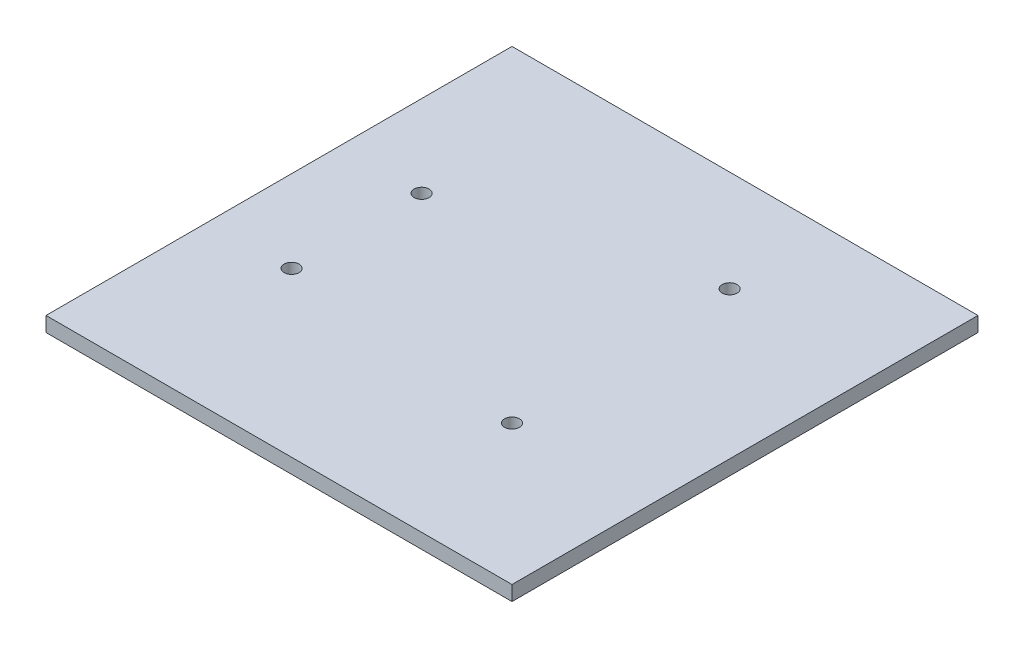
ISO-10303-21;
HEADER;
FILE_DESCRIPTION(('STEP AP214'),'2;1');
FILE_NAME('part.step','',(''),(''),'','','');
FILE_SCHEMA(('AUTOMOTIVE_DESIGN { 1 0 10303 214 1 1 1 1 }'));
ENDSEC;
DATA;
#1=APPLICATION_CONTEXT('core data for automotive mechanical design processes');
#2=APPLICATION_PROTOCOL_DEFINITION('international standard','automotive_design',2000,#1);
#3=PRODUCT_CONTEXT('',#1,'mechanical');
#4=PRODUCT('Part','Part','',(#3));
#5=PRODUCT_RELATED_PRODUCT_CATEGORY('part','',(#4));
#6=PRODUCT_DEFINITION_FORMATION('','',#4);
#7=PRODUCT_DEFINITION_CONTEXT('part definition',#1,'design');
#8=PRODUCT_DEFINITION('design','',#6,#7);
#9=PRODUCT_DEFINITION_SHAPE('','',#8);
#10=(LENGTH_UNIT() NAMED_UNIT(*) SI_UNIT(.MILLI.,.METRE.));
#11=(NAMED_UNIT(*) PLANE_ANGLE_UNIT() SI_UNIT($,.RADIAN.));
#12=(NAMED_UNIT(*) SI_UNIT($,.STERADIAN.) SOLID_ANGLE_UNIT());
#13=UNCERTAINTY_MEASURE_WITH_UNIT(LENGTH_MEASURE(1.E-05),#10,'distance_accuracy_value','');
#14=(GEOMETRIC_REPRESENTATION_CONTEXT(3) GLOBAL_UNCERTAINTY_ASSIGNED_CONTEXT((#13)) GLOBAL_UNIT_ASSIGNED_CONTEXT((#10,
#11,#12)) REPRESENTATION_CONTEXT('',''));
#15=CARTESIAN_POINT('',(0.,0.,0.));
#16=DIRECTION('',(0.,0.,1.));
#17=DIRECTION('',(1.,0.,0.));
#18=AXIS2_PLACEMENT_3D('',#15,#16,#17);
#19=CARTESIAN_POINT('',(50.,3.18,50.));
#20=DIRECTION('',(0.,0.,1.));
#21=DIRECTION('',(1.,0.,0.));
#22=AXIS2_PLACEMENT_3D('',#19,#20,#21);
#23=PLANE('',#22);
#24=DIRECTION('',(-1.,0.,0.));
#25=VECTOR('',#24,1.);
#26=CARTESIAN_POINT('',(50.,0.,50.));
#27=LINE('',#26,#25);
#28=CARTESIAN_POINT('',(50.,0.,50.));
#29=VERTEX_POINT('',#28);
#30=CARTESIAN_POINT('',(-50.,0.,50.));
#31=VERTEX_POINT('',#30);
#32=EDGE_CURVE('E99',#29,#31,#27,.T.);
#33=ORIENTED_EDGE('',*,*,#32,.F.);
#34=DIRECTION('',(0.,-1.,0.));
#35=VECTOR('',#34,1.);
#36=CARTESIAN_POINT('',(50.,3.18,50.));
#37=LINE('',#36,#35);
#38=CARTESIAN_POINT('',(50.,3.18,50.));
#39=VERTEX_POINT('',#38);
#40=EDGE_CURVE('E11',#39,#29,#37,.T.);
#41=ORIENTED_EDGE('',*,*,#40,.F.);
#42=DIRECTION('',(-1.,0.,0.));
#43=VECTOR('',#42,1.);
#44=CARTESIAN_POINT('',(50.,3.18,50.));
#45=LINE('',#44,#43);
#46=CARTESIAN_POINT('',(-50.,3.18,50.));
#47=VERTEX_POINT('',#46);
#48=EDGE_CURVE('E92',#39,#47,#45,.T.);
#49=ORIENTED_EDGE('',*,*,#48,.T.);
#50=DIRECTION('',(0.,-1.,0.));
#51=VECTOR('',#50,1.);
#52=CARTESIAN_POINT('',(-50.,3.18,50.));
#53=LINE('',#52,#51);
#54=EDGE_CURVE('E37',#47,#31,#53,.T.);
#55=ORIENTED_EDGE('',*,*,#54,.T.);
#56=EDGE_LOOP('',(#33,#41,#49,#55));
#57=FACE_BOUND('',#56,.T.);
#58=ADVANCED_FACE('F34',(#57),#23,.T.);
#59=CARTESIAN_POINT('',(50.,3.18,-50.));
#60=DIRECTION('',(1.,0.,0.));
#61=DIRECTION('',(0.,0.,-1.));
#62=AXIS2_PLACEMENT_3D('',#59,#60,#61);
#63=PLANE('',#62);
#64=DIRECTION('',(0.,0.,1.));
#65=VECTOR('',#64,1.);
#66=CARTESIAN_POINT('',(50.,0.,-50.));
#67=LINE('',#66,#65);
#68=CARTESIAN_POINT('',(50.,0.,-50.));
#69=VERTEX_POINT('',#68);
#70=EDGE_CURVE('E94',#69,#29,#67,.T.);
#71=ORIENTED_EDGE('',*,*,#70,.F.);
#72=DIRECTION('',(0.,-1.,0.));
#73=VECTOR('',#72,1.);
#74=CARTESIAN_POINT('',(50.,3.18,-50.));
#75=LINE('',#74,#73);
#76=CARTESIAN_POINT('',(50.,3.18,-50.));
#77=VERTEX_POINT('',#76);
#78=EDGE_CURVE('E43',#77,#69,#75,.T.);
#79=ORIENTED_EDGE('',*,*,#78,.F.);
#80=DIRECTION('',(0.,0.,1.));
#81=VECTOR('',#80,1.);
#82=CARTESIAN_POINT('',(50.,3.18,-50.));
#83=LINE('',#82,#81);
#84=EDGE_CURVE('E82',#77,#39,#83,.T.);
#85=ORIENTED_EDGE('',*,*,#84,.T.);
#86=ORIENTED_EDGE('',*,*,#40,.T.);
#87=EDGE_LOOP('',(#71,#79,#85,#86));
#88=FACE_BOUND('',#87,.T.);
#89=ADVANCED_FACE('F110',(#88),#63,.T.);
#90=CARTESIAN_POINT('',(50.,3.18,-50.));
#91=DIRECTION('',(0.,0.,1.));
#92=DIRECTION('',(1.,0.,0.));
#93=AXIS2_PLACEMENT_3D('',#90,#91,#92);
#94=PLANE('',#93);
#95=DIRECTION('',(-1.,0.,0.));
#96=VECTOR('',#95,1.);
#97=CARTESIAN_POINT('',(50.,0.,-50.));
#98=LINE('',#97,#96);
#99=CARTESIAN_POINT('',(-50.,0.,-50.));
#100=VERTEX_POINT('',#99);
#101=EDGE_CURVE('E87',#69,#100,#98,.T.);
#102=ORIENTED_EDGE('',*,*,#101,.T.);
#103=DIRECTION('',(0.,-1.,0.));
#104=VECTOR('',#103,1.);
#105=CARTESIAN_POINT('',(-50.,3.18,-50.));
#106=LINE('',#105,#104);
#107=CARTESIAN_POINT('',(-50.,3.18,-50.));
#108=VERTEX_POINT('',#107);
#109=EDGE_CURVE('E85',#108,#100,#106,.T.);
#110=ORIENTED_EDGE('',*,*,#109,.F.);
#111=DIRECTION('',(-1.,0.,0.));
#112=VECTOR('',#111,1.);
#113=CARTESIAN_POINT('',(50.,3.18,-50.));
#114=LINE('',#113,#112);
#115=EDGE_CURVE('E79',#77,#108,#114,.T.);
#116=ORIENTED_EDGE('',*,*,#115,.F.);
#117=ORIENTED_EDGE('',*,*,#78,.T.);
#118=EDGE_LOOP('',(#102,#110,#116,#117));
#119=FACE_BOUND('',#118,.T.);
#120=ADVANCED_FACE('F86',(#119),#94,.F.);
#121=CARTESIAN_POINT('',(-50.,3.18,-50.));
#122=DIRECTION('',(1.,0.,0.));
#123=DIRECTION('',(0.,0.,-1.));
#124=AXIS2_PLACEMENT_3D('',#121,#122,#123);
#125=PLANE('',#124);
#126=DIRECTION('',(0.,0.,1.));
#127=VECTOR('',#126,1.);
#128=CARTESIAN_POINT('',(-50.,0.,-50.));
#129=LINE('',#128,#127);
#130=EDGE_CURVE('E102',#100,#31,#129,.T.);
#131=ORIENTED_EDGE('',*,*,#130,.T.);
#132=ORIENTED_EDGE('',*,*,#54,.F.);
#133=DIRECTION('',(0.,0.,1.));
#134=VECTOR('',#133,1.);
#135=CARTESIAN_POINT('',(-50.,3.18,-50.));
#136=LINE('',#135,#134);
#137=EDGE_CURVE('E76',#108,#47,#136,.T.);
#138=ORIENTED_EDGE('',*,*,#137,.F.);
#139=ORIENTED_EDGE('',*,*,#109,.T.);
#140=EDGE_LOOP('',(#131,#132,#138,#139));
#141=FACE_BOUND('',#140,.T.);
#142=ADVANCED_FACE('F91',(#141),#125,.F.);
#143=CARTESIAN_POINT('',(0.,3.18,0.));
#144=DIRECTION('',(0.,1.,0.));
#145=DIRECTION('',(0.,0.,1.));
#146=AXIS2_PLACEMENT_3D('',#143,#144,#145);
#147=PLANE('',#146);
#148=CARTESIAN_POINT('',(20.,3.18,20.));
#149=DIRECTION('',(0.,1.,0.));
#150=DIRECTION('',(0.,0.,1.));
#151=AXIS2_PLACEMENT_3D('',#148,#149,#150);
#152=CIRCLE('',#151,1.60000000000001);
#153=CARTESIAN_POINT('',(20.,3.18,21.6));
#154=VERTEX_POINT('',#153);
#155=EDGE_CURVE('E170',#154,#154,#152,.T.);
#156=ORIENTED_EDGE('',*,*,#155,.F.);
#157=EDGE_LOOP('',(#156));
#158=FACE_BOUND('',#157,.T.);
#159=CARTESIAN_POINT('',(18.4,3.18,-28.3));
#160=DIRECTION('',(0.,1.,0.));
#161=DIRECTION('',(0.,0.,1.));
#162=AXIS2_PLACEMENT_3D('',#159,#160,#161);
#163=CIRCLE('',#162,1.60000000000001);
#164=CARTESIAN_POINT('',(18.4,3.18,-26.7));
#165=VERTEX_POINT('',#164);
#166=EDGE_CURVE('E162',#165,#165,#163,.T.);
#167=ORIENTED_EDGE('',*,*,#166,.F.);
#168=EDGE_LOOP('',(#167));
#169=FACE_BOUND('',#168,.T.);
#170=CARTESIAN_POINT('',(-32.4,3.18,14.9));
#171=DIRECTION('',(0.,1.,0.));
#172=DIRECTION('',(0.,0.,1.));
#173=AXIS2_PLACEMENT_3D('',#170,#171,#172);
#174=CIRCLE('',#173,1.60000000000001);
#175=CARTESIAN_POINT('',(-32.4,3.18,16.5));
#176=VERTEX_POINT('',#175);
#177=EDGE_CURVE('E155',#176,#176,#174,.T.);
#178=ORIENTED_EDGE('',*,*,#177,.F.);
#179=EDGE_LOOP('',(#178));
#180=FACE_BOUND('',#179,.T.);
#181=CARTESIAN_POINT('',(-32.4,3.18,-13.));
#182=DIRECTION('',(0.,1.,0.));
#183=DIRECTION('',(0.,0.,1.));
#184=AXIS2_PLACEMENT_3D('',#181,#182,#183);
#185=CIRCLE('',#184,1.60000000000001);
#186=CARTESIAN_POINT('',(-32.4,3.18,-11.4));
#187=VERTEX_POINT('',#186);
#188=EDGE_CURVE('E159',#187,#187,#185,.T.);
#189=ORIENTED_EDGE('',*,*,#188,.F.);
#190=EDGE_LOOP('',(#189));
#191=FACE_BOUND('',#190,.T.);
#192=ORIENTED_EDGE('',*,*,#48,.F.);
#193=ORIENTED_EDGE('',*,*,#84,.F.);
#194=ORIENTED_EDGE('',*,*,#115,.T.);
#195=ORIENTED_EDGE('',*,*,#137,.T.);
#196=EDGE_LOOP('',(#192,#193,#194,#195));
#197=FACE_BOUND('',#196,.T.);
#198=ADVANCED_FACE('F81',(#158,#169,#180,#191,#197),#147,.T.);
#199=CARTESIAN_POINT('',(0.,0.,0.));
#200=DIRECTION('',(0.,1.,0.));
#201=DIRECTION('',(0.,0.,1.));
#202=AXIS2_PLACEMENT_3D('',#199,#200,#201);
#203=PLANE('',#202);
#204=CARTESIAN_POINT('',(20.,0.,20.));
#205=DIRECTION('',(0.,1.,0.));
#206=DIRECTION('',(0.,0.,1.));
#207=AXIS2_PLACEMENT_3D('',#204,#205,#206);
#208=CIRCLE('',#207,1.60000000000001);
#209=CARTESIAN_POINT('',(20.,0.,21.6));
#210=VERTEX_POINT('',#209);
#211=EDGE_CURVE('E167',#210,#210,#208,.T.);
#212=ORIENTED_EDGE('',*,*,#211,.T.);
#213=EDGE_LOOP('',(#212));
#214=FACE_BOUND('',#213,.T.);
#215=CARTESIAN_POINT('',(18.4,0.,-28.3));
#216=DIRECTION('',(0.,1.,0.));
#217=DIRECTION('',(0.,0.,1.));
#218=AXIS2_PLACEMENT_3D('',#215,#216,#217);
#219=CIRCLE('',#218,1.60000000000001);
#220=CARTESIAN_POINT('',(18.4,0.,-26.7));
#221=VERTEX_POINT('',#220);
#222=EDGE_CURVE('E157',#221,#221,#219,.T.);
#223=ORIENTED_EDGE('',*,*,#222,.T.);
#224=EDGE_LOOP('',(#223));
#225=FACE_BOUND('',#224,.T.);
#226=CARTESIAN_POINT('',(-32.4,0.,14.9));
#227=DIRECTION('',(0.,1.,0.));
#228=DIRECTION('',(0.,0.,1.));
#229=AXIS2_PLACEMENT_3D('',#226,#227,#228);
#230=CIRCLE('',#229,1.60000000000001);
#231=CARTESIAN_POINT('',(-32.4,0.,16.5));
#232=VERTEX_POINT('',#231);
#233=EDGE_CURVE('E152',#232,#232,#230,.T.);
#234=ORIENTED_EDGE('',*,*,#233,.T.);
#235=EDGE_LOOP('',(#234));
#236=FACE_BOUND('',#235,.T.);
#237=CARTESIAN_POINT('',(-32.4,0.,-13.));
#238=DIRECTION('',(0.,1.,0.));
#239=DIRECTION('',(0.,0.,1.));
#240=AXIS2_PLACEMENT_3D('',#237,#238,#239);
#241=CIRCLE('',#240,1.60000000000001);
#242=CARTESIAN_POINT('',(-32.4,0.,-11.4));
#243=VERTEX_POINT('',#242);
#244=EDGE_CURVE('E103',#243,#243,#241,.T.);
#245=ORIENTED_EDGE('',*,*,#244,.T.);
#246=EDGE_LOOP('',(#245));
#247=FACE_BOUND('',#246,.T.);
#248=ORIENTED_EDGE('',*,*,#32,.T.);
#249=ORIENTED_EDGE('',*,*,#130,.F.);
#250=ORIENTED_EDGE('',*,*,#101,.F.);
#251=ORIENTED_EDGE('',*,*,#70,.T.);
#252=EDGE_LOOP('',(#248,#249,#250,#251));
#253=FACE_BOUND('',#252,.T.);
#254=ADVANCED_FACE('F109',(#214,#225,#236,#247,#253),#203,.F.);
#255=CARTESIAN_POINT('',(-32.4,0.,-13.));
#256=DIRECTION('',(0.,1.,0.));
#257=DIRECTION('',(0.,0.,1.));
#258=AXIS2_PLACEMENT_3D('',#255,#256,#257);
#259=CYLINDRICAL_SURFACE('',#258,1.60000000000001);
#260=ORIENTED_EDGE('',*,*,#244,.F.);
#261=EDGE_LOOP('',(#260));
#262=FACE_BOUND('',#261,.T.);
#263=ORIENTED_EDGE('',*,*,#188,.T.);
#264=EDGE_LOOP('',(#263));
#265=FACE_BOUND('',#264,.T.);
#266=ADVANCED_FACE('F128',(#262,#265),#259,.F.);
#267=CARTESIAN_POINT('',(-32.4,0.,14.9));
#268=DIRECTION('',(0.,1.,0.));
#269=DIRECTION('',(0.,0.,1.));
#270=AXIS2_PLACEMENT_3D('',#267,#268,#269);
#271=CYLINDRICAL_SURFACE('',#270,1.60000000000001);
#272=ORIENTED_EDGE('',*,*,#233,.F.);
#273=EDGE_LOOP('',(#272));
#274=FACE_BOUND('',#273,.T.);
#275=ORIENTED_EDGE('',*,*,#177,.T.);
#276=EDGE_LOOP('',(#275));
#277=FACE_BOUND('',#276,.T.);
#278=ADVANCED_FACE('F135',(#274,#277),#271,.F.);
#279=CARTESIAN_POINT('',(18.4,0.,-28.3));
#280=DIRECTION('',(0.,1.,0.));
#281=DIRECTION('',(0.,0.,1.));
#282=AXIS2_PLACEMENT_3D('',#279,#280,#281);
#283=CYLINDRICAL_SURFACE('',#282,1.60000000000001);
#284=ORIENTED_EDGE('',*,*,#222,.F.);
#285=EDGE_LOOP('',(#284));
#286=FACE_BOUND('',#285,.T.);
#287=ORIENTED_EDGE('',*,*,#166,.T.);
#288=EDGE_LOOP('',(#287));
#289=FACE_BOUND('',#288,.T.);
#290=ADVANCED_FACE('F140',(#286,#289),#283,.F.);
#291=CARTESIAN_POINT('',(20.,0.,20.));
#292=DIRECTION('',(0.,1.,0.));
#293=DIRECTION('',(0.,0.,1.));
#294=AXIS2_PLACEMENT_3D('',#291,#292,#293);
#295=CYLINDRICAL_SURFACE('',#294,1.60000000000001);
#296=ORIENTED_EDGE('',*,*,#211,.F.);
#297=EDGE_LOOP('',(#296));
#298=FACE_BOUND('',#297,.T.);
#299=ORIENTED_EDGE('',*,*,#155,.T.);
#300=EDGE_LOOP('',(#299));
#301=FACE_BOUND('',#300,.T.);
#302=ADVANCED_FACE('F137',(#298,#301),#295,.F.);
#303=CLOSED_SHELL('',(#58,#89,#120,#142,#198,#254,#266,#278,#290,#302));
#304=MANIFOLD_SOLID_BREP('B2',#303);
#305=ADVANCED_BREP_SHAPE_REPRESENTATION('',(#18,#304),#14);
#306=SHAPE_DEFINITION_REPRESENTATION(#9,#305);
ENDSEC;
END-ISO-10303-21;
